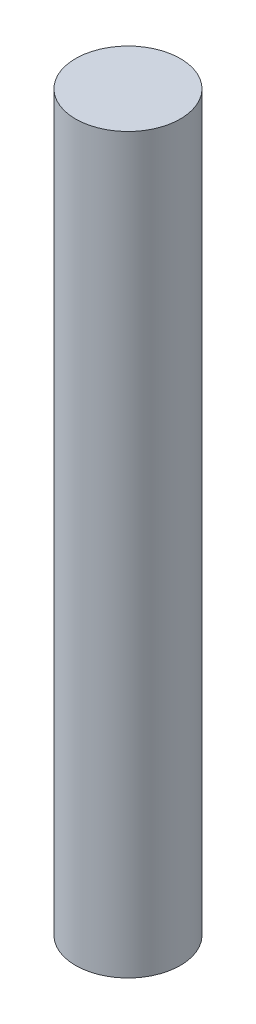
ISO-10303-21;
HEADER;
FILE_DESCRIPTION(('STEP AP214'),'2;1');
FILE_NAME('part.step','',(''),(''),'','','');
FILE_SCHEMA(('AUTOMOTIVE_DESIGN { 1 0 10303 214 1 1 1 1 }'));
ENDSEC;
DATA;
#1=APPLICATION_CONTEXT('core data for automotive mechanical design processes');
#2=APPLICATION_PROTOCOL_DEFINITION('international standard','automotive_design',2000,#1);
#3=PRODUCT_CONTEXT('',#1,'mechanical');
#4=PRODUCT('Part','Part','',(#3));
#5=PRODUCT_RELATED_PRODUCT_CATEGORY('part','',(#4));
#6=PRODUCT_DEFINITION_FORMATION('','',#4);
#7=PRODUCT_DEFINITION_CONTEXT('part definition',#1,'design');
#8=PRODUCT_DEFINITION('design','',#6,#7);
#9=PRODUCT_DEFINITION_SHAPE('','',#8);
#10=(LENGTH_UNIT() NAMED_UNIT(*) SI_UNIT(.MILLI.,.METRE.));
#11=(NAMED_UNIT(*) PLANE_ANGLE_UNIT() SI_UNIT($,.RADIAN.));
#12=(NAMED_UNIT(*) SI_UNIT($,.STERADIAN.) SOLID_ANGLE_UNIT());
#13=UNCERTAINTY_MEASURE_WITH_UNIT(LENGTH_MEASURE(1.E-05),#10,'distance_accuracy_value','');
#14=(GEOMETRIC_REPRESENTATION_CONTEXT(3) GLOBAL_UNCERTAINTY_ASSIGNED_CONTEXT((#13)) GLOBAL_UNIT_ASSIGNED_CONTEXT((#10,
#11,#12)) REPRESENTATION_CONTEXT('',''));
#15=CARTESIAN_POINT('',(0.,0.,0.));
#16=DIRECTION('',(0.,0.,1.));
#17=DIRECTION('',(1.,0.,0.));
#18=AXIS2_PLACEMENT_3D('',#15,#16,#17);
#19=CARTESIAN_POINT('',(0.,14.,0.));
#20=DIRECTION('',(0.,-1.,0.));
#21=DIRECTION('',(0.,0.,-1.));
#22=AXIS2_PLACEMENT_3D('',#19,#20,#21);
#23=CYLINDRICAL_SURFACE('',#22,1.);
#24=CARTESIAN_POINT('',(0.,14.,0.));
#25=DIRECTION('',(0.,1.,0.));
#26=DIRECTION('',(0.,0.,1.));
#27=AXIS2_PLACEMENT_3D('',#24,#25,#26);
#28=CIRCLE('',#27,1.);
#29=CARTESIAN_POINT('',(0.,14.,1.));
#30=VERTEX_POINT('',#29);
#31=EDGE_CURVE('E10',#30,#30,#28,.T.);
#32=ORIENTED_EDGE('',*,*,#31,.F.);
#33=EDGE_LOOP('',(#32));
#34=FACE_BOUND('',#33,.T.);
#35=CARTESIAN_POINT('',(0.,0.,0.));
#36=DIRECTION('',(0.,1.,0.));
#37=DIRECTION('',(0.,0.,1.));
#38=AXIS2_PLACEMENT_3D('',#35,#36,#37);
#39=CIRCLE('',#38,1.);
#40=CARTESIAN_POINT('',(0.,0.,1.));
#41=VERTEX_POINT('',#40);
#42=EDGE_CURVE('E40',#41,#41,#39,.T.);
#43=ORIENTED_EDGE('',*,*,#42,.T.);
#44=EDGE_LOOP('',(#43));
#45=FACE_BOUND('',#44,.T.);
#46=ADVANCED_FACE('F37',(#34,#45),#23,.T.);
#47=CARTESIAN_POINT('',(0.,14.,0.));
#48=DIRECTION('',(0.,1.,0.));
#49=DIRECTION('',(0.,0.,1.));
#50=AXIS2_PLACEMENT_3D('',#47,#48,#49);
#51=PLANE('',#50);
#52=ORIENTED_EDGE('',*,*,#31,.T.);
#53=EDGE_LOOP('',(#52));
#54=FACE_BOUND('',#53,.T.);
#55=ADVANCED_FACE('F54',(#54),#51,.T.);
#56=CARTESIAN_POINT('',(0.,0.,0.));
#57=DIRECTION('',(0.,1.,0.));
#58=DIRECTION('',(0.,0.,1.));
#59=AXIS2_PLACEMENT_3D('',#56,#57,#58);
#60=PLANE('',#59);
#61=ORIENTED_EDGE('',*,*,#42,.F.);
#62=EDGE_LOOP('',(#61));
#63=FACE_BOUND('',#62,.T.);
#64=ADVANCED_FACE('F52',(#63),#60,.F.);
#65=CLOSED_SHELL('',(#46,#55,#64));
#66=MANIFOLD_SOLID_BREP('B2',#65);
#67=ADVANCED_BREP_SHAPE_REPRESENTATION('',(#18,#66),#14);
#68=SHAPE_DEFINITION_REPRESENTATION(#9,#67);
ENDSEC;
END-ISO-10303-21;
